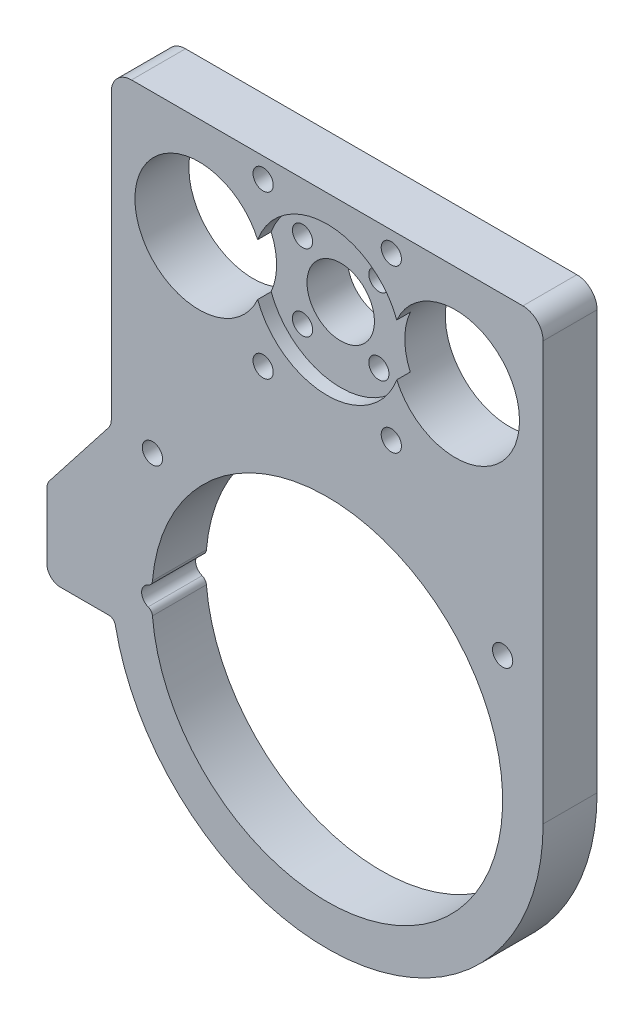
ISO-10303-21;
HEADER;
FILE_DESCRIPTION(('STEP AP214'),'2;1');
FILE_NAME('part.step','',(''),(''),'','','');
FILE_SCHEMA(('AUTOMOTIVE_DESIGN { 1 0 10303 214 1 1 1 1 }'));
ENDSEC;
DATA;
#1=APPLICATION_CONTEXT('core data for automotive mechanical design processes');
#2=APPLICATION_PROTOCOL_DEFINITION('international standard','automotive_design',2000,#1);
#3=PRODUCT_CONTEXT('',#1,'mechanical');
#4=PRODUCT('Part','Part','',(#3));
#5=PRODUCT_RELATED_PRODUCT_CATEGORY('part','',(#4));
#6=PRODUCT_DEFINITION_FORMATION('','',#4);
#7=PRODUCT_DEFINITION_CONTEXT('part definition',#1,'design');
#8=PRODUCT_DEFINITION('design','',#6,#7);
#9=PRODUCT_DEFINITION_SHAPE('','',#8);
#10=(LENGTH_UNIT() NAMED_UNIT(*) SI_UNIT(.MILLI.,.METRE.));
#11=(NAMED_UNIT(*) PLANE_ANGLE_UNIT() SI_UNIT($,.RADIAN.));
#12=(NAMED_UNIT(*) SI_UNIT($,.STERADIAN.) SOLID_ANGLE_UNIT());
#13=UNCERTAINTY_MEASURE_WITH_UNIT(LENGTH_MEASURE(1.E-05),#10,'distance_accuracy_value','');
#14=(GEOMETRIC_REPRESENTATION_CONTEXT(3) GLOBAL_UNCERTAINTY_ASSIGNED_CONTEXT((#13)) GLOBAL_UNIT_ASSIGNED_CONTEXT((#10,
#11,#12)) REPRESENTATION_CONTEXT('',''));
#15=CARTESIAN_POINT('',(0.,0.,0.));
#16=DIRECTION('',(0.,0.,1.));
#17=DIRECTION('',(1.,0.,0.));
#18=AXIS2_PLACEMENT_3D('',#15,#16,#17);
#19=CARTESIAN_POINT('',(0.,0.,8.));
#20=DIRECTION('',(0.,0.,-1.));
#21=DIRECTION('',(-1.,0.,0.));
#22=AXIS2_PLACEMENT_3D('',#19,#20,#21);
#23=CYLINDRICAL_SURFACE('',#22,5.);
#24=CARTESIAN_POINT('',(0.,0.,0.));
#25=DIRECTION('',(0.,0.,1.));
#26=DIRECTION('',(1.,0.,0.));
#27=AXIS2_PLACEMENT_3D('',#24,#25,#26);
#28=CIRCLE('',#27,5.);
#29=CARTESIAN_POINT('',(5.,0.,0.));
#30=VERTEX_POINT('',#29);
#31=EDGE_CURVE('E209',#30,#30,#28,.T.);
#32=ORIENTED_EDGE('',*,*,#31,.F.);
#33=EDGE_LOOP('',(#32));
#34=FACE_BOUND('',#33,.T.);
#35=CARTESIAN_POINT('',(0.,0.,6.));
#36=DIRECTION('',(0.,0.,1.));
#37=DIRECTION('',(1.,0.,0.));
#38=AXIS2_PLACEMENT_3D('',#35,#36,#37);
#39=CIRCLE('',#38,5.);
#40=CARTESIAN_POINT('',(5.,0.,6.));
#41=VERTEX_POINT('',#40);
#42=EDGE_CURVE('E319',#41,#41,#39,.T.);
#43=ORIENTED_EDGE('',*,*,#42,.T.);
#44=EDGE_LOOP('',(#43));
#45=FACE_BOUND('',#44,.T.);
#46=ADVANCED_FACE('F33',(#34,#45),#23,.F.);
#47=CARTESIAN_POINT('',(-5.65685424949239,5.65685424949237,8.));
#48=DIRECTION('',(0.,0.,-1.));
#49=DIRECTION('',(-1.,0.,0.));
#50=AXIS2_PLACEMENT_3D('',#47,#48,#49);
#51=CYLINDRICAL_SURFACE('',#50,1.5);
#52=CARTESIAN_POINT('',(-5.65685424949239,5.65685424949237,0.));
#53=DIRECTION('',(0.,0.,1.));
#54=DIRECTION('',(1.,0.,0.));
#55=AXIS2_PLACEMENT_3D('',#52,#53,#54);
#56=CIRCLE('',#55,1.5);
#57=CARTESIAN_POINT('',(-4.15685424949239,5.65685424949237,0.));
#58=VERTEX_POINT('',#57);
#59=EDGE_CURVE('E377',#58,#58,#56,.T.);
#60=ORIENTED_EDGE('',*,*,#59,.F.);
#61=EDGE_LOOP('',(#60));
#62=FACE_BOUND('',#61,.T.);
#63=CARTESIAN_POINT('',(-5.65685424949239,5.65685424949237,6.));
#64=DIRECTION('',(0.,0.,1.));
#65=DIRECTION('',(1.,0.,0.));
#66=AXIS2_PLACEMENT_3D('',#63,#64,#65);
#67=CIRCLE('',#66,1.5);
#68=CARTESIAN_POINT('',(-4.15685424949239,5.65685424949237,6.));
#69=VERTEX_POINT('',#68);
#70=EDGE_CURVE('E316',#69,#69,#67,.T.);
#71=ORIENTED_EDGE('',*,*,#70,.T.);
#72=EDGE_LOOP('',(#71));
#73=FACE_BOUND('',#72,.T.);
#74=ADVANCED_FACE('F435',(#62,#73),#51,.F.);
#75=CARTESIAN_POINT('',(5.65685424949239,5.65685424949237,8.));
#76=DIRECTION('',(0.,0.,-1.));
#77=DIRECTION('',(-1.,0.,0.));
#78=AXIS2_PLACEMENT_3D('',#75,#76,#77);
#79=CYLINDRICAL_SURFACE('',#78,1.5);
#80=CARTESIAN_POINT('',(5.65685424949239,5.65685424949237,0.));
#81=DIRECTION('',(0.,0.,1.));
#82=DIRECTION('',(1.,0.,0.));
#83=AXIS2_PLACEMENT_3D('',#80,#81,#82);
#84=CIRCLE('',#83,1.5);
#85=CARTESIAN_POINT('',(7.15685424949239,5.65685424949237,0.));
#86=VERTEX_POINT('',#85);
#87=EDGE_CURVE('E374',#86,#86,#84,.T.);
#88=ORIENTED_EDGE('',*,*,#87,.F.);
#89=EDGE_LOOP('',(#88));
#90=FACE_BOUND('',#89,.T.);
#91=CARTESIAN_POINT('',(5.65685424949239,5.65685424949237,6.));
#92=DIRECTION('',(0.,0.,1.));
#93=DIRECTION('',(1.,0.,0.));
#94=AXIS2_PLACEMENT_3D('',#91,#92,#93);
#95=CIRCLE('',#94,1.5);
#96=CARTESIAN_POINT('',(7.15685424949239,5.65685424949237,6.));
#97=VERTEX_POINT('',#96);
#98=EDGE_CURVE('E322',#97,#97,#95,.T.);
#99=ORIENTED_EDGE('',*,*,#98,.T.);
#100=EDGE_LOOP('',(#99));
#101=FACE_BOUND('',#100,.T.);
#102=ADVANCED_FACE('F441',(#90,#101),#79,.F.);
#103=CARTESIAN_POINT('',(5.65685424949235,-5.65685424949241,8.));
#104=DIRECTION('',(0.,0.,-1.));
#105=DIRECTION('',(-1.,0.,0.));
#106=AXIS2_PLACEMENT_3D('',#103,#104,#105);
#107=CYLINDRICAL_SURFACE('',#106,1.5);
#108=CARTESIAN_POINT('',(5.65685424949235,-5.65685424949241,0.));
#109=DIRECTION('',(0.,0.,1.));
#110=DIRECTION('',(1.,0.,0.));
#111=AXIS2_PLACEMENT_3D('',#108,#109,#110);
#112=CIRCLE('',#111,1.5);
#113=CARTESIAN_POINT('',(7.15685424949235,-5.65685424949241,0.));
#114=VERTEX_POINT('',#113);
#115=EDGE_CURVE('E371',#114,#114,#112,.T.);
#116=ORIENTED_EDGE('',*,*,#115,.F.);
#117=EDGE_LOOP('',(#116));
#118=FACE_BOUND('',#117,.T.);
#119=CARTESIAN_POINT('',(5.65685424949235,-5.65685424949241,6.));
#120=DIRECTION('',(0.,0.,1.));
#121=DIRECTION('',(1.,0.,0.));
#122=AXIS2_PLACEMENT_3D('',#119,#120,#121);
#123=CIRCLE('',#122,1.5);
#124=CARTESIAN_POINT('',(7.15685424949235,-5.65685424949241,6.));
#125=VERTEX_POINT('',#124);
#126=EDGE_CURVE('E310',#125,#125,#123,.T.);
#127=ORIENTED_EDGE('',*,*,#126,.T.);
#128=EDGE_LOOP('',(#127));
#129=FACE_BOUND('',#128,.T.);
#130=ADVANCED_FACE('F574',(#118,#129),#107,.F.);
#131=CARTESIAN_POINT('',(-5.65685424949243,-5.65685424949233,8.));
#132=DIRECTION('',(0.,0.,-1.));
#133=DIRECTION('',(-1.,0.,0.));
#134=AXIS2_PLACEMENT_3D('',#131,#132,#133);
#135=CYLINDRICAL_SURFACE('',#134,1.5);
#136=CARTESIAN_POINT('',(-5.65685424949243,-5.65685424949233,0.));
#137=DIRECTION('',(0.,0.,1.));
#138=DIRECTION('',(1.,0.,0.));
#139=AXIS2_PLACEMENT_3D('',#136,#137,#138);
#140=CIRCLE('',#139,1.5);
#141=CARTESIAN_POINT('',(-4.15685424949243,-5.65685424949233,0.));
#142=VERTEX_POINT('',#141);
#143=EDGE_CURVE('E366',#142,#142,#140,.T.);
#144=ORIENTED_EDGE('',*,*,#143,.F.);
#145=EDGE_LOOP('',(#144));
#146=FACE_BOUND('',#145,.T.);
#147=CARTESIAN_POINT('',(-5.65685424949243,-5.65685424949233,6.));
#148=DIRECTION('',(0.,0.,1.));
#149=DIRECTION('',(1.,0.,0.));
#150=AXIS2_PLACEMENT_3D('',#147,#148,#149);
#151=CIRCLE('',#150,1.5);
#152=CARTESIAN_POINT('',(-4.15685424949243,-5.65685424949233,6.));
#153=VERTEX_POINT('',#152);
#154=EDGE_CURVE('E308',#153,#153,#151,.T.);
#155=ORIENTED_EDGE('',*,*,#154,.T.);
#156=EDGE_LOOP('',(#155));
#157=FACE_BOUND('',#156,.T.);
#158=ADVANCED_FACE('F452',(#146,#157),#135,.F.);
#159=CARTESIAN_POINT('',(-39.543986336221,-43.7154165076583,8.));
#160=DIRECTION('',(0.,0.,-1.));
#161=DIRECTION('',(-1.,0.,0.));
#162=AXIS2_PLACEMENT_3D('',#159,#160,#161);
#163=PLANE('',#162);
#164=CARTESIAN_POINT('',(-19.,0.,8.));
#165=DIRECTION('',(0.,0.,1.));
#166=DIRECTION('',(1.,0.,0.));
#167=AXIS2_PLACEMENT_3D('',#164,#165,#166);
#168=CIRCLE('',#167,9.5);
#169=CARTESIAN_POINT('',(-10.3092105263158,3.83668845804552,8.));
#170=VERTEX_POINT('',#169);
#171=CARTESIAN_POINT('',(-10.3092105263158,-3.83668845804552,8.));
#172=VERTEX_POINT('',#171);
#173=EDGE_CURVE('E192',#170,#172,#168,.T.);
#174=ORIENTED_EDGE('',*,*,#173,.F.);
#175=CARTESIAN_POINT('',(0.,0.,8.));
#176=DIRECTION('',(0.,0.,1.));
#177=DIRECTION('',(1.,0.,0.));
#178=AXIS2_PLACEMENT_3D('',#175,#176,#177);
#179=CIRCLE('',#178,11.);
#180=CARTESIAN_POINT('',(10.3092105263158,3.83668845804552,8.));
#181=VERTEX_POINT('',#180);
#182=EDGE_CURVE('E177',#181,#170,#179,.T.);
#183=ORIENTED_EDGE('',*,*,#182,.F.);
#184=CARTESIAN_POINT('',(19.,0.,8.));
#185=DIRECTION('',(0.,0.,1.));
#186=DIRECTION('',(1.,0.,0.));
#187=AXIS2_PLACEMENT_3D('',#184,#185,#186);
#188=CIRCLE('',#187,9.5);
#189=CARTESIAN_POINT('',(10.3092105263158,-3.83668845804552,8.));
#190=VERTEX_POINT('',#189);
#191=EDGE_CURVE('E190',#190,#181,#188,.T.);
#192=ORIENTED_EDGE('',*,*,#191,.F.);
#193=EDGE_CURVE('E193',#172,#190,#179,.T.);
#194=ORIENTED_EDGE('',*,*,#193,.F.);
#195=EDGE_LOOP('',(#174,#183,#192,#194));
#196=FACE_BOUND('',#195,.T.);
#197=CARTESIAN_POINT('',(-39.543986336221,-43.7154165076583,8.));
#198=DIRECTION('',(0.,0.,1.));
#199=DIRECTION('',(-1.,0.,0.));
#200=AXIS2_PLACEMENT_3D('',#197,#198,#199);
#201=CIRCLE('',#200,2.);
#202=CARTESIAN_POINT('',(-41.1197426131827,-42.4837541531082,8.));
#203=VERTEX_POINT('',#202);
#204=CARTESIAN_POINT('',(-41.543986336221,-43.7154165076583,8.));
#205=VERTEX_POINT('',#204);
#206=EDGE_CURVE('E214',#203,#205,#201,.T.);
#207=ORIENTED_EDGE('',*,*,#206,.T.);
#208=DIRECTION('',(0.,-1.,0.));
#209=VECTOR('',#208,1.);
#210=CARTESIAN_POINT('',(-41.543986336221,-52.6838036105186,8.));
#211=LINE('',#210,#209);
#212=CARTESIAN_POINT('',(-41.543986336221,-53.3830220155881,8.));
#213=VERTEX_POINT('',#212);
#214=EDGE_CURVE('E217',#205,#213,#211,.T.);
#215=ORIENTED_EDGE('',*,*,#214,.T.);
#216=CARTESIAN_POINT('',(-39.543986336221,-53.3830220155881,8.));
#217=DIRECTION('',(0.,0.,1.));
#218=DIRECTION('',(1.,0.,0.));
#219=AXIS2_PLACEMENT_3D('',#216,#217,#218);
#220=CIRCLE('',#219,2.00000000000001);
#221=CARTESIAN_POINT('',(-39.543986336221,-55.3830220155881,8.));
#222=VERTEX_POINT('',#221);
#223=EDGE_CURVE('E220',#213,#222,#220,.T.);
#224=ORIENTED_EDGE('',*,*,#223,.T.);
#225=DIRECTION('',(1.,0.,0.));
#226=VECTOR('',#225,1.);
#227=CARTESIAN_POINT('',(-39.543986336221,-55.3830220155881,8.));
#228=LINE('',#227,#226);
#229=CARTESIAN_POINT('',(-32.3767977099113,-55.3830220155881,8.));
#230=VERTEX_POINT('',#229);
#231=EDGE_CURVE('E222',#222,#230,#228,.T.);
#232=ORIENTED_EDGE('',*,*,#231,.T.);
#233=CARTESIAN_POINT('',(-32.3767977099113,-56.3830220155881,8.));
#234=DIRECTION('',(0.,0.,-1.));
#235=DIRECTION('',(-1.,0.,0.));
#236=AXIS2_PLACEMENT_3D('',#233,#234,#235);
#237=CIRCLE('',#236,0.999999999999994);
#238=CARTESIAN_POINT('',(-31.3956826277928,-56.1895971060248,8.));
#239=VERTEX_POINT('',#238);
#240=EDGE_CURVE('E224',#230,#239,#237,.T.);
#241=ORIENTED_EDGE('',*,*,#240,.T.);
#242=CARTESIAN_POINT('',(0.,-50.,8.));
#243=DIRECTION('',(0.,0.,1.));
#244=DIRECTION('',(1.,0.,0.));
#245=AXIS2_PLACEMENT_3D('',#242,#243,#244);
#246=CIRCLE('',#245,32.);
#247=CARTESIAN_POINT('',(32.,-50.,8.));
#248=VERTEX_POINT('',#247);
#249=EDGE_CURVE('E226',#239,#248,#246,.T.);
#250=ORIENTED_EDGE('',*,*,#249,.T.);
#251=DIRECTION('',(0.,1.,0.));
#252=VECTOR('',#251,1.);
#253=CARTESIAN_POINT('',(32.,-50.,8.));
#254=LINE('',#253,#252);
#255=CARTESIAN_POINT('',(32.,12.,8.));
#256=VERTEX_POINT('',#255);
#257=EDGE_CURVE('E228',#248,#256,#254,.T.);
#258=ORIENTED_EDGE('',*,*,#257,.T.);
#259=CARTESIAN_POINT('',(29.,12.,8.));
#260=DIRECTION('',(0.,0.,1.));
#261=DIRECTION('',(-1.,0.,0.));
#262=AXIS2_PLACEMENT_3D('',#259,#260,#261);
#263=CIRCLE('',#262,3.);
#264=CARTESIAN_POINT('',(29.,15.,8.));
#265=VERTEX_POINT('',#264);
#266=EDGE_CURVE('E230',#256,#265,#263,.T.);
#267=ORIENTED_EDGE('',*,*,#266,.T.);
#268=DIRECTION('',(-1.,0.,0.));
#269=VECTOR('',#268,1.);
#270=CARTESIAN_POINT('',(-29.,15.,8.));
#271=LINE('',#270,#269);
#272=CARTESIAN_POINT('',(-29.,15.,8.));
#273=VERTEX_POINT('',#272);
#274=EDGE_CURVE('E232',#265,#273,#271,.T.);
#275=ORIENTED_EDGE('',*,*,#274,.T.);
#276=CARTESIAN_POINT('',(-29.,12.,8.));
#277=DIRECTION('',(0.,0.,1.));
#278=DIRECTION('',(-1.,0.,0.));
#279=AXIS2_PLACEMENT_3D('',#276,#277,#278);
#280=CIRCLE('',#279,3.);
#281=CARTESIAN_POINT('',(-32.,12.,8.));
#282=VERTEX_POINT('',#281);
#283=EDGE_CURVE('E234',#273,#282,#280,.T.);
#284=ORIENTED_EDGE('',*,*,#283,.T.);
#285=DIRECTION('',(0.,-1.,0.));
#286=VECTOR('',#285,1.);
#287=CARTESIAN_POINT('',(-32.,-17.,8.));
#288=LINE('',#287,#286);
#289=CARTESIAN_POINT('',(-32.,-30.1273002460359,8.));
#290=VERTEX_POINT('',#289);
#291=EDGE_CURVE('E236',#282,#290,#288,.T.);
#292=ORIENTED_EDGE('',*,*,#291,.T.);
#293=CARTESIAN_POINT('',(-34.,-30.1273002460359,8.));
#294=DIRECTION('',(0.,0.,-1.));
#295=DIRECTION('',(-1.,0.,0.));
#296=AXIS2_PLACEMENT_3D('',#293,#294,#295);
#297=CIRCLE('',#296,2.00000000000001);
#298=CARTESIAN_POINT('',(-32.4242437230383,-31.358962600586,8.));
#299=VERTEX_POINT('',#298);
#300=EDGE_CURVE('E238',#290,#299,#297,.T.);
#301=ORIENTED_EDGE('',*,*,#300,.T.);
#302=DIRECTION('',(-0.615831177275038,-0.787878138480844,0.));
#303=VECTOR('',#302,1.);
#304=CARTESIAN_POINT('',(-41.1197426131827,-42.4837541531082,8.));
#305=LINE('',#304,#303);
#306=EDGE_CURVE('E240',#299,#203,#305,.T.);
#307=ORIENTED_EDGE('',*,*,#306,.T.);
#308=EDGE_LOOP('',(#207,#215,#224,#232,#241,#250,#258,#267,#275,#284,#292,#301,#307));
#309=FACE_BOUND('',#308,.T.);
#310=CARTESIAN_POINT('',(-26.8990384615385,-52.3327515608557,8.));
#311=DIRECTION('',(0.,0.,-1.));
#312=DIRECTION('',(-1.,0.,0.));
#313=AXIS2_PLACEMENT_3D('',#310,#311,#312);
#314=CIRCLE('',#313,1.);
#315=CARTESIAN_POINT('',(-26.5394230769231,-51.3996509365134,8.));
#316=VERTEX_POINT('',#315);
#317=CARTESIAN_POINT('',(-25.9027777777778,-52.2463533548981,8.));
#318=VERTEX_POINT('',#317);
#319=EDGE_CURVE('E381',#316,#318,#314,.T.);
#320=ORIENTED_EDGE('',*,*,#319,.F.);
#321=CARTESIAN_POINT('',(-26.,-50.,8.));
#322=DIRECTION('',(0.,0.,1.));
#323=DIRECTION('',(1.,0.,0.));
#324=AXIS2_PLACEMENT_3D('',#321,#322,#323);
#325=CIRCLE('',#324,1.50000000000003);
#326=CARTESIAN_POINT('',(-26.5394230769231,-48.6003490634866,8.));
#327=VERTEX_POINT('',#326);
#328=EDGE_CURVE('E388',#327,#316,#325,.T.);
#329=ORIENTED_EDGE('',*,*,#328,.F.);
#330=CARTESIAN_POINT('',(-26.8990384615385,-47.6672484391443,8.));
#331=DIRECTION('',(0.,0.,-1.));
#332=DIRECTION('',(1.,0.,0.));
#333=AXIS2_PLACEMENT_3D('',#330,#331,#332);
#334=CIRCLE('',#333,1.);
#335=CARTESIAN_POINT('',(-25.9027777777778,-47.7536466451019,8.));
#336=VERTEX_POINT('',#335);
#337=EDGE_CURVE('E386',#336,#327,#334,.T.);
#338=ORIENTED_EDGE('',*,*,#337,.F.);
#339=CARTESIAN_POINT('',(0.,-50.,8.));
#340=DIRECTION('',(0.,0.,1.));
#341=DIRECTION('',(1.,0.,0.));
#342=AXIS2_PLACEMENT_3D('',#339,#340,#341);
#343=CIRCLE('',#342,26.);
#344=EDGE_CURVE('E383',#318,#336,#343,.T.);
#345=ORIENTED_EDGE('',*,*,#344,.F.);
#346=EDGE_LOOP('',(#320,#329,#338,#345));
#347=FACE_BOUND('',#346,.T.);
#348=CARTESIAN_POINT('',(-9.5,12.,8.));
#349=DIRECTION('',(0.,0.,1.));
#350=DIRECTION('',(1.,0.,0.));
#351=AXIS2_PLACEMENT_3D('',#348,#349,#350);
#352=CIRCLE('',#351,1.5);
#353=CARTESIAN_POINT('',(-8.,12.,8.));
#354=VERTEX_POINT('',#353);
#355=EDGE_CURVE('E363',#354,#354,#352,.T.);
#356=ORIENTED_EDGE('',*,*,#355,.F.);
#357=EDGE_LOOP('',(#356));
#358=FACE_BOUND('',#357,.T.);
#359=CARTESIAN_POINT('',(9.5,12.,8.));
#360=DIRECTION('',(0.,0.,1.));
#361=DIRECTION('',(1.,0.,0.));
#362=AXIS2_PLACEMENT_3D('',#359,#360,#361);
#363=CIRCLE('',#362,1.5);
#364=CARTESIAN_POINT('',(11.,12.,8.));
#365=VERTEX_POINT('',#364);
#366=EDGE_CURVE('E357',#365,#365,#363,.T.);
#367=ORIENTED_EDGE('',*,*,#366,.F.);
#368=EDGE_LOOP('',(#367));
#369=FACE_BOUND('',#368,.T.);
#370=CARTESIAN_POINT('',(9.5,-12.,8.));
#371=DIRECTION('',(0.,0.,1.));
#372=DIRECTION('',(1.,0.,0.));
#373=AXIS2_PLACEMENT_3D('',#370,#371,#372);
#374=CIRCLE('',#373,1.5);
#375=CARTESIAN_POINT('',(11.,-12.,8.));
#376=VERTEX_POINT('',#375);
#377=EDGE_CURVE('E351',#376,#376,#374,.T.);
#378=ORIENTED_EDGE('',*,*,#377,.F.);
#379=EDGE_LOOP('',(#378));
#380=FACE_BOUND('',#379,.T.);
#381=CARTESIAN_POINT('',(-9.5,-12.,8.));
#382=DIRECTION('',(0.,0.,1.));
#383=DIRECTION('',(1.,0.,0.));
#384=AXIS2_PLACEMENT_3D('',#381,#382,#383);
#385=CIRCLE('',#384,1.5);
#386=CARTESIAN_POINT('',(-8.,-12.,8.));
#387=VERTEX_POINT('',#386);
#388=EDGE_CURVE('E345',#387,#387,#385,.T.);
#389=ORIENTED_EDGE('',*,*,#388,.F.);
#390=EDGE_LOOP('',(#389));
#391=FACE_BOUND('',#390,.T.);
#392=CARTESIAN_POINT('',(-25.9027777777778,-31.358962600586,8.));
#393=DIRECTION('',(0.,0.,1.));
#394=DIRECTION('',(1.,0.,0.));
#395=AXIS2_PLACEMENT_3D('',#392,#393,#394);
#396=CIRCLE('',#395,1.5);
#397=CARTESIAN_POINT('',(-24.4027777777778,-31.358962600586,8.));
#398=VERTEX_POINT('',#397);
#399=EDGE_CURVE('E339',#398,#398,#396,.T.);
#400=ORIENTED_EDGE('',*,*,#399,.F.);
#401=EDGE_LOOP('',(#400));
#402=FACE_BOUND('',#401,.T.);
#403=CARTESIAN_POINT('',(26.,-31.358962600586,8.));
#404=DIRECTION('',(0.,0.,1.));
#405=DIRECTION('',(1.,0.,0.));
#406=AXIS2_PLACEMENT_3D('',#403,#404,#405);
#407=CIRCLE('',#406,1.5);
#408=CARTESIAN_POINT('',(27.5,-31.358962600586,8.));
#409=VERTEX_POINT('',#408);
#410=EDGE_CURVE('E333',#409,#409,#407,.T.);
#411=ORIENTED_EDGE('',*,*,#410,.F.);
#412=EDGE_LOOP('',(#411));
#413=FACE_BOUND('',#412,.T.);
#414=ADVANCED_FACE('F187',(#196,#309,#347,#358,#369,#380,#391,#402,#413),#163,.F.);
#415=CARTESIAN_POINT('',(-39.543986336221,-43.7154165076583,0.));
#416=DIRECTION('',(0.,0.,-1.));
#417=DIRECTION('',(-1.,0.,0.));
#418=AXIS2_PLACEMENT_3D('',#415,#416,#417);
#419=PLANE('',#418);
#420=CARTESIAN_POINT('',(-25.9027777777778,-31.358962600586,0.));
#421=DIRECTION('',(0.,0.,1.));
#422=DIRECTION('',(1.,0.,0.));
#423=AXIS2_PLACEMENT_3D('',#420,#421,#422);
#424=CIRCLE('',#423,1.5);
#425=CARTESIAN_POINT('',(-24.4027777777778,-31.358962600586,0.));
#426=VERTEX_POINT('',#425);
#427=EDGE_CURVE('E336',#426,#426,#424,.T.);
#428=ORIENTED_EDGE('',*,*,#427,.T.);
#429=EDGE_LOOP('',(#428));
#430=FACE_BOUND('',#429,.T.);
#431=CARTESIAN_POINT('',(9.5,-12.,0.));
#432=DIRECTION('',(0.,0.,1.));
#433=DIRECTION('',(1.,0.,0.));
#434=AXIS2_PLACEMENT_3D('',#431,#432,#433);
#435=CIRCLE('',#434,1.5);
#436=CARTESIAN_POINT('',(11.,-12.,0.));
#437=VERTEX_POINT('',#436);
#438=EDGE_CURVE('E348',#437,#437,#435,.T.);
#439=ORIENTED_EDGE('',*,*,#438,.T.);
#440=EDGE_LOOP('',(#439));
#441=FACE_BOUND('',#440,.T.);
#442=CARTESIAN_POINT('',(-9.5,12.,0.));
#443=DIRECTION('',(0.,0.,1.));
#444=DIRECTION('',(1.,0.,0.));
#445=AXIS2_PLACEMENT_3D('',#442,#443,#444);
#446=CIRCLE('',#445,1.5);
#447=CARTESIAN_POINT('',(-8.,12.,0.));
#448=VERTEX_POINT('',#447);
#449=EDGE_CURVE('E360',#448,#448,#446,.T.);
#450=ORIENTED_EDGE('',*,*,#449,.T.);
#451=EDGE_LOOP('',(#450));
#452=FACE_BOUND('',#451,.T.);
#453=ORIENTED_EDGE('',*,*,#115,.T.);
#454=EDGE_LOOP('',(#453));
#455=FACE_BOUND('',#454,.T.);
#456=ORIENTED_EDGE('',*,*,#59,.T.);
#457=EDGE_LOOP('',(#456));
#458=FACE_BOUND('',#457,.T.);
#459=CARTESIAN_POINT('',(-19.,0.,0.));
#460=DIRECTION('',(0.,0.,1.));
#461=DIRECTION('',(1.,0.,0.));
#462=AXIS2_PLACEMENT_3D('',#459,#460,#461);
#463=CIRCLE('',#462,9.5);
#464=CARTESIAN_POINT('',(-9.5,0.,0.));
#465=VERTEX_POINT('',#464);
#466=EDGE_CURVE('E198',#465,#465,#463,.T.);
#467=ORIENTED_EDGE('',*,*,#466,.T.);
#468=EDGE_LOOP('',(#467));
#469=FACE_BOUND('',#468,.T.);
#470=CARTESIAN_POINT('',(-39.543986336221,-43.7154165076583,0.));
#471=DIRECTION('',(0.,0.,1.));
#472=DIRECTION('',(-1.,0.,0.));
#473=AXIS2_PLACEMENT_3D('',#470,#471,#472);
#474=CIRCLE('',#473,2.);
#475=CARTESIAN_POINT('',(-41.1197426131827,-42.4837541531082,0.));
#476=VERTEX_POINT('',#475);
#477=CARTESIAN_POINT('',(-41.543986336221,-43.7154165076583,0.));
#478=VERTEX_POINT('',#477);
#479=EDGE_CURVE('E213',#476,#478,#474,.T.);
#480=ORIENTED_EDGE('',*,*,#479,.F.);
#481=DIRECTION('',(-0.615831177275038,-0.787878138480844,0.));
#482=VECTOR('',#481,1.);
#483=CARTESIAN_POINT('',(-41.1197426131827,-42.4837541531082,0.));
#484=LINE('',#483,#482);
#485=CARTESIAN_POINT('',(-32.4242437230383,-31.358962600586,0.));
#486=VERTEX_POINT('',#485);
#487=EDGE_CURVE('E218',#486,#476,#484,.T.);
#488=ORIENTED_EDGE('',*,*,#487,.F.);
#489=CARTESIAN_POINT('',(-34.,-30.1273002460359,0.));
#490=DIRECTION('',(0.,0.,-1.));
#491=DIRECTION('',(-1.,0.,0.));
#492=AXIS2_PLACEMENT_3D('',#489,#490,#491);
#493=CIRCLE('',#492,2.00000000000001);
#494=CARTESIAN_POINT('',(-32.,-30.1273002460359,0.));
#495=VERTEX_POINT('',#494);
#496=EDGE_CURVE('E267',#495,#486,#493,.T.);
#497=ORIENTED_EDGE('',*,*,#496,.F.);
#498=DIRECTION('',(0.,-1.,0.));
#499=VECTOR('',#498,1.);
#500=CARTESIAN_POINT('',(-32.,-30.1273002460359,0.));
#501=LINE('',#500,#499);
#502=CARTESIAN_POINT('',(-32.,12.,0.));
#503=VERTEX_POINT('',#502);
#504=EDGE_CURVE('E265',#503,#495,#501,.T.);
#505=ORIENTED_EDGE('',*,*,#504,.F.);
#506=CARTESIAN_POINT('',(-29.,12.,0.));
#507=DIRECTION('',(0.,0.,1.));
#508=DIRECTION('',(-1.,0.,0.));
#509=AXIS2_PLACEMENT_3D('',#506,#507,#508);
#510=CIRCLE('',#509,3.);
#511=CARTESIAN_POINT('',(-29.,15.,0.));
#512=VERTEX_POINT('',#511);
#513=EDGE_CURVE('E262',#512,#503,#510,.T.);
#514=ORIENTED_EDGE('',*,*,#513,.F.);
#515=DIRECTION('',(-1.,0.,0.));
#516=VECTOR('',#515,1.);
#517=CARTESIAN_POINT('',(-29.,15.,0.));
#518=LINE('',#517,#516);
#519=CARTESIAN_POINT('',(29.,15.,0.));
#520=VERTEX_POINT('',#519);
#521=EDGE_CURVE('E260',#520,#512,#518,.T.);
#522=ORIENTED_EDGE('',*,*,#521,.F.);
#523=CARTESIAN_POINT('',(29.,12.,0.));
#524=DIRECTION('',(0.,0.,1.));
#525=DIRECTION('',(-1.,0.,0.));
#526=AXIS2_PLACEMENT_3D('',#523,#524,#525);
#527=CIRCLE('',#526,3.);
#528=CARTESIAN_POINT('',(32.,12.,0.));
#529=VERTEX_POINT('',#528);
#530=EDGE_CURVE('E258',#529,#520,#527,.T.);
#531=ORIENTED_EDGE('',*,*,#530,.F.);
#532=DIRECTION('',(0.,1.,0.));
#533=VECTOR('',#532,1.);
#534=CARTESIAN_POINT('',(32.,-17.,0.));
#535=LINE('',#534,#533);
#536=CARTESIAN_POINT('',(32.,-50.,0.));
#537=VERTEX_POINT('',#536);
#538=EDGE_CURVE('E256',#537,#529,#535,.T.);
#539=ORIENTED_EDGE('',*,*,#538,.F.);
#540=CARTESIAN_POINT('',(0.,-50.,0.));
#541=DIRECTION('',(0.,0.,1.));
#542=DIRECTION('',(1.,0.,0.));
#543=AXIS2_PLACEMENT_3D('',#540,#541,#542);
#544=CIRCLE('',#543,32.);
#545=CARTESIAN_POINT('',(-31.3956826277928,-56.1895971060248,0.));
#546=VERTEX_POINT('',#545);
#547=EDGE_CURVE('E253',#546,#537,#544,.T.);
#548=ORIENTED_EDGE('',*,*,#547,.F.);
#549=CARTESIAN_POINT('',(-32.3767977099113,-56.3830220155881,0.));
#550=DIRECTION('',(0.,0.,-1.));
#551=DIRECTION('',(-1.,0.,0.));
#552=AXIS2_PLACEMENT_3D('',#549,#550,#551);
#553=CIRCLE('',#552,0.999999999999994);
#554=CARTESIAN_POINT('',(-32.3767977099113,-55.3830220155881,0.));
#555=VERTEX_POINT('',#554);
#556=EDGE_CURVE('E251',#555,#546,#553,.T.);
#557=ORIENTED_EDGE('',*,*,#556,.F.);
#558=DIRECTION('',(1.,0.,0.));
#559=VECTOR('',#558,1.);
#560=CARTESIAN_POINT('',(-39.543986336221,-55.3830220155881,0.));
#561=LINE('',#560,#559);
#562=CARTESIAN_POINT('',(-39.543986336221,-55.3830220155881,0.));
#563=VERTEX_POINT('',#562);
#564=EDGE_CURVE('E249',#563,#555,#561,.T.);
#565=ORIENTED_EDGE('',*,*,#564,.F.);
#566=CARTESIAN_POINT('',(-39.543986336221,-53.3830220155881,0.));
#567=DIRECTION('',(0.,0.,1.));
#568=DIRECTION('',(1.,0.,0.));
#569=AXIS2_PLACEMENT_3D('',#566,#567,#568);
#570=CIRCLE('',#569,2.00000000000001);
#571=CARTESIAN_POINT('',(-41.543986336221,-53.3830220155881,0.));
#572=VERTEX_POINT('',#571);
#573=EDGE_CURVE('E247',#572,#563,#570,.T.);
#574=ORIENTED_EDGE('',*,*,#573,.F.);
#575=DIRECTION('',(0.,-1.,0.));
#576=VECTOR('',#575,1.);
#577=CARTESIAN_POINT('',(-41.543986336221,-52.6838036105186,0.));
#578=LINE('',#577,#576);
#579=EDGE_CURVE('E245',#478,#572,#578,.T.);
#580=ORIENTED_EDGE('',*,*,#579,.F.);
#581=EDGE_LOOP('',(#480,#488,#497,#505,#514,#522,#531,#539,#548,#557,#565,#574,#580));
#582=FACE_BOUND('',#581,.T.);
#583=ORIENTED_EDGE('',*,*,#31,.T.);
#584=EDGE_LOOP('',(#583));
#585=FACE_BOUND('',#584,.T.);
#586=CARTESIAN_POINT('',(19.,0.,0.));
#587=DIRECTION('',(0.,0.,1.));
#588=DIRECTION('',(1.,0.,0.));
#589=AXIS2_PLACEMENT_3D('',#586,#587,#588);
#590=CIRCLE('',#589,9.5);
#591=CARTESIAN_POINT('',(28.5,0.,0.));
#592=VERTEX_POINT('',#591);
#593=EDGE_CURVE('E199',#592,#592,#590,.T.);
#594=ORIENTED_EDGE('',*,*,#593,.T.);
#595=EDGE_LOOP('',(#594));
#596=FACE_BOUND('',#595,.T.);
#597=CARTESIAN_POINT('',(-26.,-50.,0.));
#598=DIRECTION('',(0.,0.,1.));
#599=DIRECTION('',(1.,0.,0.));
#600=AXIS2_PLACEMENT_3D('',#597,#598,#599);
#601=CIRCLE('',#600,1.50000000000003);
#602=CARTESIAN_POINT('',(-26.5394230769231,-48.6003490634866,0.));
#603=VERTEX_POINT('',#602);
#604=CARTESIAN_POINT('',(-26.5394230769231,-51.3996509365134,0.));
#605=VERTEX_POINT('',#604);
#606=EDGE_CURVE('E384',#603,#605,#601,.T.);
#607=ORIENTED_EDGE('',*,*,#606,.T.);
#608=CARTESIAN_POINT('',(-26.8990384615385,-52.3327515608557,0.));
#609=DIRECTION('',(0.,0.,-1.));
#610=DIRECTION('',(-1.,0.,0.));
#611=AXIS2_PLACEMENT_3D('',#608,#609,#610);
#612=CIRCLE('',#611,1.);
#613=CARTESIAN_POINT('',(-25.9027777777778,-52.2463533548981,0.));
#614=VERTEX_POINT('',#613);
#615=EDGE_CURVE('E380',#605,#614,#612,.T.);
#616=ORIENTED_EDGE('',*,*,#615,.T.);
#617=CARTESIAN_POINT('',(0.,-50.,0.));
#618=DIRECTION('',(0.,0.,1.));
#619=DIRECTION('',(1.,0.,0.));
#620=AXIS2_PLACEMENT_3D('',#617,#618,#619);
#621=CIRCLE('',#620,26.);
#622=CARTESIAN_POINT('',(-25.9027777777778,-47.7536466451019,0.));
#623=VERTEX_POINT('',#622);
#624=EDGE_CURVE('E393',#614,#623,#621,.T.);
#625=ORIENTED_EDGE('',*,*,#624,.T.);
#626=CARTESIAN_POINT('',(-26.8990384615385,-47.6672484391443,0.));
#627=DIRECTION('',(0.,0.,-1.));
#628=DIRECTION('',(1.,0.,0.));
#629=AXIS2_PLACEMENT_3D('',#626,#627,#628);
#630=CIRCLE('',#629,1.);
#631=EDGE_CURVE('E396',#623,#603,#630,.T.);
#632=ORIENTED_EDGE('',*,*,#631,.T.);
#633=EDGE_LOOP('',(#607,#616,#625,#632));
#634=FACE_BOUND('',#633,.T.);
#635=ORIENTED_EDGE('',*,*,#87,.T.);
#636=EDGE_LOOP('',(#635));
#637=FACE_BOUND('',#636,.T.);
#638=ORIENTED_EDGE('',*,*,#143,.T.);
#639=EDGE_LOOP('',(#638));
#640=FACE_BOUND('',#639,.T.);
#641=CARTESIAN_POINT('',(9.5,12.,0.));
#642=DIRECTION('',(0.,0.,1.));
#643=DIRECTION('',(1.,0.,0.));
#644=AXIS2_PLACEMENT_3D('',#641,#642,#643);
#645=CIRCLE('',#644,1.5);
#646=CARTESIAN_POINT('',(11.,12.,0.));
#647=VERTEX_POINT('',#646);
#648=EDGE_CURVE('E354',#647,#647,#645,.T.);
#649=ORIENTED_EDGE('',*,*,#648,.T.);
#650=EDGE_LOOP('',(#649));
#651=FACE_BOUND('',#650,.T.);
#652=CARTESIAN_POINT('',(-9.5,-12.,0.));
#653=DIRECTION('',(0.,0.,1.));
#654=DIRECTION('',(1.,0.,0.));
#655=AXIS2_PLACEMENT_3D('',#652,#653,#654);
#656=CIRCLE('',#655,1.5);
#657=CARTESIAN_POINT('',(-8.,-12.,0.));
#658=VERTEX_POINT('',#657);
#659=EDGE_CURVE('E342',#658,#658,#656,.T.);
#660=ORIENTED_EDGE('',*,*,#659,.T.);
#661=EDGE_LOOP('',(#660));
#662=FACE_BOUND('',#661,.T.);
#663=CARTESIAN_POINT('',(26.,-31.358962600586,0.));
#664=DIRECTION('',(0.,0.,1.));
#665=DIRECTION('',(1.,0.,0.));
#666=AXIS2_PLACEMENT_3D('',#663,#664,#665);
#667=CIRCLE('',#666,1.5);
#668=CARTESIAN_POINT('',(27.5,-31.358962600586,0.));
#669=VERTEX_POINT('',#668);
#670=EDGE_CURVE('E332',#669,#669,#667,.T.);
#671=ORIENTED_EDGE('',*,*,#670,.T.);
#672=EDGE_LOOP('',(#671));
#673=FACE_BOUND('',#672,.T.);
#674=ADVANCED_FACE('F415',(#430,#441,#452,#455,#458,#469,#582,#585,#596,#634,#637,#640,#651,
#662,#673),#419,.T.);
#675=CARTESIAN_POINT('',(-39.543986336221,-43.7154165076583,8.));
#676=DIRECTION('',(0.,0.,-1.));
#677=DIRECTION('',(-1.,0.,0.));
#678=AXIS2_PLACEMENT_3D('',#675,#676,#677);
#679=CYLINDRICAL_SURFACE('',#678,2.);
#680=ORIENTED_EDGE('',*,*,#479,.T.);
#681=DIRECTION('',(0.,0.,-1.));
#682=VECTOR('',#681,1.);
#683=CARTESIAN_POINT('',(-41.543986336221,-43.7154165076583,8.));
#684=LINE('',#683,#682);
#685=EDGE_CURVE('E305',#205,#478,#684,.T.);
#686=ORIENTED_EDGE('',*,*,#685,.F.);
#687=ORIENTED_EDGE('',*,*,#206,.F.);
#688=DIRECTION('',(0.,0.,-1.));
#689=VECTOR('',#688,1.);
#690=CARTESIAN_POINT('',(-41.1197426131827,-42.4837541531082,8.));
#691=LINE('',#690,#689);
#692=EDGE_CURVE('E242',#203,#476,#691,.T.);
#693=ORIENTED_EDGE('',*,*,#692,.T.);
#694=EDGE_LOOP('',(#680,#686,#687,#693));
#695=FACE_BOUND('',#694,.T.);
#696=ADVANCED_FACE('F35',(#695),#679,.T.);
#697=CARTESIAN_POINT('',(-41.543986336221,-52.6838036105186,8.));
#698=DIRECTION('',(1.,0.,0.));
#699=DIRECTION('',(0.,1.,0.));
#700=AXIS2_PLACEMENT_3D('',#697,#698,#699);
#701=PLANE('',#700);
#702=ORIENTED_EDGE('',*,*,#579,.T.);
#703=DIRECTION('',(0.,0.,-1.));
#704=VECTOR('',#703,1.);
#705=CARTESIAN_POINT('',(-41.543986336221,-53.3830220155881,8.));
#706=LINE('',#705,#704);
#707=EDGE_CURVE('E302',#213,#572,#706,.T.);
#708=ORIENTED_EDGE('',*,*,#707,.F.);
#709=ORIENTED_EDGE('',*,*,#214,.F.);
#710=ORIENTED_EDGE('',*,*,#685,.T.);
#711=EDGE_LOOP('',(#702,#708,#709,#710));
#712=FACE_BOUND('',#711,.T.);
#713=ADVANCED_FACE('F498',(#712),#701,.F.);
#714=CARTESIAN_POINT('',(-39.543986336221,-53.3830220155881,8.));
#715=DIRECTION('',(0.,0.,-1.));
#716=DIRECTION('',(-1.,0.,0.));
#717=AXIS2_PLACEMENT_3D('',#714,#715,#716);
#718=CYLINDRICAL_SURFACE('',#717,2.00000000000001);
#719=ORIENTED_EDGE('',*,*,#573,.T.);
#720=DIRECTION('',(0.,0.,-1.));
#721=VECTOR('',#720,1.);
#722=CARTESIAN_POINT('',(-39.543986336221,-55.3830220155881,8.));
#723=LINE('',#722,#721);
#724=EDGE_CURVE('E299',#222,#563,#723,.T.);
#725=ORIENTED_EDGE('',*,*,#724,.F.);
#726=ORIENTED_EDGE('',*,*,#223,.F.);
#727=ORIENTED_EDGE('',*,*,#707,.T.);
#728=EDGE_LOOP('',(#719,#725,#726,#727));
#729=FACE_BOUND('',#728,.T.);
#730=ADVANCED_FACE('F495',(#729),#718,.T.);
#731=CARTESIAN_POINT('',(-39.543986336221,-55.3830220155881,8.));
#732=DIRECTION('',(0.,1.,0.));
#733=DIRECTION('',(-1.,0.,0.));
#734=AXIS2_PLACEMENT_3D('',#731,#732,#733);
#735=PLANE('',#734);
#736=ORIENTED_EDGE('',*,*,#564,.T.);
#737=DIRECTION('',(0.,0.,-1.));
#738=VECTOR('',#737,1.);
#739=CARTESIAN_POINT('',(-32.3767977099113,-55.3830220155881,8.));
#740=LINE('',#739,#738);
#741=EDGE_CURVE('E296',#230,#555,#740,.T.);
#742=ORIENTED_EDGE('',*,*,#741,.F.);
#743=ORIENTED_EDGE('',*,*,#231,.F.);
#744=ORIENTED_EDGE('',*,*,#724,.T.);
#745=EDGE_LOOP('',(#736,#742,#743,#744));
#746=FACE_BOUND('',#745,.T.);
#747=ADVANCED_FACE('F491',(#746),#735,.F.);
#748=CARTESIAN_POINT('',(-32.3767977099113,-56.3830220155881,8.));
#749=DIRECTION('',(0.,0.,-1.));
#750=DIRECTION('',(-1.,0.,0.));
#751=AXIS2_PLACEMENT_3D('',#748,#749,#750);
#752=CYLINDRICAL_SURFACE('',#751,0.999999999999994);
#753=ORIENTED_EDGE('',*,*,#556,.T.);
#754=DIRECTION('',(0.,0.,-1.));
#755=VECTOR('',#754,1.);
#756=CARTESIAN_POINT('',(-31.3956826277928,-56.1895971060248,8.));
#757=LINE('',#756,#755);
#758=EDGE_CURVE('E293',#239,#546,#757,.T.);
#759=ORIENTED_EDGE('',*,*,#758,.F.);
#760=ORIENTED_EDGE('',*,*,#240,.F.);
#761=ORIENTED_EDGE('',*,*,#741,.T.);
#762=EDGE_LOOP('',(#753,#759,#760,#761));
#763=FACE_BOUND('',#762,.T.);
#764=ADVANCED_FACE('F487',(#763),#752,.F.);
#765=CARTESIAN_POINT('',(0.,-50.,8.));
#766=DIRECTION('',(0.,0.,-1.));
#767=DIRECTION('',(-1.,0.,0.));
#768=AXIS2_PLACEMENT_3D('',#765,#766,#767);
#769=CYLINDRICAL_SURFACE('',#768,32.);
#770=ORIENTED_EDGE('',*,*,#547,.T.);
#771=DIRECTION('',(0.,0.,-1.));
#772=VECTOR('',#771,1.);
#773=CARTESIAN_POINT('',(32.,-50.,8.));
#774=LINE('',#773,#772);
#775=EDGE_CURVE('E290',#248,#537,#774,.T.);
#776=ORIENTED_EDGE('',*,*,#775,.F.);
#777=ORIENTED_EDGE('',*,*,#249,.F.);
#778=ORIENTED_EDGE('',*,*,#758,.T.);
#779=EDGE_LOOP('',(#770,#776,#777,#778));
#780=FACE_BOUND('',#779,.T.);
#781=ADVANCED_FACE('F483',(#780),#769,.T.);
#782=CARTESIAN_POINT('',(32.,-17.,8.));
#783=DIRECTION('',(-1.,0.,0.));
#784=DIRECTION('',(0.,0.,1.));
#785=AXIS2_PLACEMENT_3D('',#782,#783,#784);
#786=PLANE('',#785);
#787=ORIENTED_EDGE('',*,*,#538,.T.);
#788=DIRECTION('',(0.,0.,-1.));
#789=VECTOR('',#788,1.);
#790=CARTESIAN_POINT('',(32.,12.,8.));
#791=LINE('',#790,#789);
#792=EDGE_CURVE('E287',#256,#529,#791,.T.);
#793=ORIENTED_EDGE('',*,*,#792,.F.);
#794=ORIENTED_EDGE('',*,*,#257,.F.);
#795=ORIENTED_EDGE('',*,*,#775,.T.);
#796=EDGE_LOOP('',(#787,#793,#794,#795));
#797=FACE_BOUND('',#796,.T.);
#798=ADVANCED_FACE('F479',(#797),#786,.F.);
#799=CARTESIAN_POINT('',(29.,12.,8.));
#800=DIRECTION('',(0.,0.,-1.));
#801=DIRECTION('',(-1.,0.,0.));
#802=AXIS2_PLACEMENT_3D('',#799,#800,#801);
#803=CYLINDRICAL_SURFACE('',#802,3.);
#804=ORIENTED_EDGE('',*,*,#530,.T.);
#805=DIRECTION('',(0.,0.,-1.));
#806=VECTOR('',#805,1.);
#807=CARTESIAN_POINT('',(29.,15.,8.));
#808=LINE('',#807,#806);
#809=EDGE_CURVE('E284',#265,#520,#808,.T.);
#810=ORIENTED_EDGE('',*,*,#809,.F.);
#811=ORIENTED_EDGE('',*,*,#266,.F.);
#812=ORIENTED_EDGE('',*,*,#792,.T.);
#813=EDGE_LOOP('',(#804,#810,#811,#812));
#814=FACE_BOUND('',#813,.T.);
#815=ADVANCED_FACE('F475',(#814),#803,.T.);
#816=CARTESIAN_POINT('',(-29.,15.,8.));
#817=DIRECTION('',(0.,-1.,0.));
#818=DIRECTION('',(0.,0.,-1.));
#819=AXIS2_PLACEMENT_3D('',#816,#817,#818);
#820=PLANE('',#819);
#821=ORIENTED_EDGE('',*,*,#521,.T.);
#822=DIRECTION('',(0.,0.,-1.));
#823=VECTOR('',#822,1.);
#824=CARTESIAN_POINT('',(-29.,15.,8.));
#825=LINE('',#824,#823);
#826=EDGE_CURVE('E281',#273,#512,#825,.T.);
#827=ORIENTED_EDGE('',*,*,#826,.F.);
#828=ORIENTED_EDGE('',*,*,#274,.F.);
#829=ORIENTED_EDGE('',*,*,#809,.T.);
#830=EDGE_LOOP('',(#821,#827,#828,#829));
#831=FACE_BOUND('',#830,.T.);
#832=ADVANCED_FACE('F471',(#831),#820,.F.);
#833=CARTESIAN_POINT('',(-29.,12.,8.));
#834=DIRECTION('',(0.,0.,-1.));
#835=DIRECTION('',(-1.,0.,0.));
#836=AXIS2_PLACEMENT_3D('',#833,#834,#835);
#837=CYLINDRICAL_SURFACE('',#836,3.);
#838=ORIENTED_EDGE('',*,*,#513,.T.);
#839=DIRECTION('',(0.,0.,-1.));
#840=VECTOR('',#839,1.);
#841=CARTESIAN_POINT('',(-32.,12.,8.));
#842=LINE('',#841,#840);
#843=EDGE_CURVE('E278',#282,#503,#842,.T.);
#844=ORIENTED_EDGE('',*,*,#843,.F.);
#845=ORIENTED_EDGE('',*,*,#283,.F.);
#846=ORIENTED_EDGE('',*,*,#826,.T.);
#847=EDGE_LOOP('',(#838,#844,#845,#846));
#848=FACE_BOUND('',#847,.T.);
#849=ADVANCED_FACE('F467',(#848),#837,.T.);
#850=CARTESIAN_POINT('',(-32.,-30.1273002460359,8.));
#851=DIRECTION('',(1.,0.,0.));
#852=DIRECTION('',(0.,1.,0.));
#853=AXIS2_PLACEMENT_3D('',#850,#851,#852);
#854=PLANE('',#853);
#855=ORIENTED_EDGE('',*,*,#504,.T.);
#856=DIRECTION('',(0.,0.,-1.));
#857=VECTOR('',#856,1.);
#858=CARTESIAN_POINT('',(-32.,-30.1273002460359,8.));
#859=LINE('',#858,#857);
#860=EDGE_CURVE('E275',#290,#495,#859,.T.);
#861=ORIENTED_EDGE('',*,*,#860,.F.);
#862=ORIENTED_EDGE('',*,*,#291,.F.);
#863=ORIENTED_EDGE('',*,*,#843,.T.);
#864=EDGE_LOOP('',(#855,#861,#862,#863));
#865=FACE_BOUND('',#864,.T.);
#866=ADVANCED_FACE('F463',(#865),#854,.F.);
#867=CARTESIAN_POINT('',(-34.,-30.1273002460359,8.));
#868=DIRECTION('',(0.,0.,-1.));
#869=DIRECTION('',(-1.,0.,0.));
#870=AXIS2_PLACEMENT_3D('',#867,#868,#869);
#871=CYLINDRICAL_SURFACE('',#870,2.00000000000001);
#872=ORIENTED_EDGE('',*,*,#496,.T.);
#873=DIRECTION('',(0.,0.,-1.));
#874=VECTOR('',#873,1.);
#875=CARTESIAN_POINT('',(-32.4242437230383,-31.358962600586,8.));
#876=LINE('',#875,#874);
#877=EDGE_CURVE('E272',#299,#486,#876,.T.);
#878=ORIENTED_EDGE('',*,*,#877,.F.);
#879=ORIENTED_EDGE('',*,*,#300,.F.);
#880=ORIENTED_EDGE('',*,*,#860,.T.);
#881=EDGE_LOOP('',(#872,#878,#879,#880));
#882=FACE_BOUND('',#881,.T.);
#883=ADVANCED_FACE('F459',(#882),#871,.F.);
#884=CARTESIAN_POINT('',(-41.1197426131827,-42.4837541531082,8.));
#885=DIRECTION('',(0.787878138480844,-0.615831177275038,0.));
#886=DIRECTION('',(0.615831177275038,0.787878138480844,0.));
#887=AXIS2_PLACEMENT_3D('',#884,#885,#886);
#888=PLANE('',#887);
#889=ORIENTED_EDGE('',*,*,#487,.T.);
#890=ORIENTED_EDGE('',*,*,#692,.F.);
#891=ORIENTED_EDGE('',*,*,#306,.F.);
#892=ORIENTED_EDGE('',*,*,#877,.T.);
#893=EDGE_LOOP('',(#889,#890,#891,#892));
#894=FACE_BOUND('',#893,.T.);
#895=ADVANCED_FACE('F456',(#894),#888,.F.);
#896=CARTESIAN_POINT('',(-19.,0.,8.));
#897=DIRECTION('',(0.,0.,-1.));
#898=DIRECTION('',(-1.,0.,0.));
#899=AXIS2_PLACEMENT_3D('',#896,#897,#898);
#900=CYLINDRICAL_SURFACE('',#899,9.5);
#901=DIRECTION('',(0.,0.,1.));
#902=VECTOR('',#901,1.);
#903=CARTESIAN_POINT('',(-10.3092105263158,-3.83668845804552,7.));
#904=LINE('',#903,#902);
#905=CARTESIAN_POINT('',(-10.3092105263158,-3.83668845804552,6.));
#906=VERTEX_POINT('',#905);
#907=EDGE_CURVE('E330',#906,#172,#904,.T.);
#908=ORIENTED_EDGE('',*,*,#907,.F.);
#909=CARTESIAN_POINT('',(-19.,0.,6.));
#910=DIRECTION('',(0.,0.,1.));
#911=DIRECTION('',(1.,0.,0.));
#912=AXIS2_PLACEMENT_3D('',#909,#910,#911);
#913=CIRCLE('',#912,9.5);
#914=CARTESIAN_POINT('',(-10.3092105263158,3.83668845804552,6.));
#915=VERTEX_POINT('',#914);
#916=EDGE_CURVE('E315',#906,#915,#913,.T.);
#917=ORIENTED_EDGE('',*,*,#916,.T.);
#918=DIRECTION('',(0.,0.,1.));
#919=VECTOR('',#918,1.);
#920=CARTESIAN_POINT('',(-10.3092105263158,3.83668845804552,7.));
#921=LINE('',#920,#919);
#922=EDGE_CURVE('E328',#170,#915,#921,.F.);
#923=ORIENTED_EDGE('',*,*,#922,.F.);
#924=ORIENTED_EDGE('',*,*,#173,.T.);
#925=EDGE_LOOP('',(#908,#917,#923,#924));
#926=FACE_BOUND('',#925,.T.);
#927=ORIENTED_EDGE('',*,*,#466,.F.);
#928=EDGE_LOOP('',(#927));
#929=FACE_BOUND('',#928,.T.);
#930=ADVANCED_FACE('F448',(#926,#929),#900,.F.);
#931=CARTESIAN_POINT('',(19.,0.,8.));
#932=DIRECTION('',(0.,0.,-1.));
#933=DIRECTION('',(-1.,0.,0.));
#934=AXIS2_PLACEMENT_3D('',#931,#932,#933);
#935=CYLINDRICAL_SURFACE('',#934,9.5);
#936=DIRECTION('',(0.,0.,1.));
#937=VECTOR('',#936,1.);
#938=CARTESIAN_POINT('',(10.3092105263158,3.83668845804552,7.));
#939=LINE('',#938,#937);
#940=CARTESIAN_POINT('',(10.3092105263158,3.83668845804552,6.));
#941=VERTEX_POINT('',#940);
#942=EDGE_CURVE('E11',#941,#181,#939,.T.);
#943=ORIENTED_EDGE('',*,*,#942,.F.);
#944=CARTESIAN_POINT('',(19.,0.,6.));
#945=DIRECTION('',(0.,0.,1.));
#946=DIRECTION('',(1.,0.,0.));
#947=AXIS2_PLACEMENT_3D('',#944,#945,#946);
#948=CIRCLE('',#947,9.5);
#949=CARTESIAN_POINT('',(10.3092105263158,-3.83668845804552,6.));
#950=VERTEX_POINT('',#949);
#951=EDGE_CURVE('E314',#941,#950,#948,.T.);
#952=ORIENTED_EDGE('',*,*,#951,.T.);
#953=DIRECTION('',(0.,0.,1.));
#954=VECTOR('',#953,1.);
#955=CARTESIAN_POINT('',(10.3092105263158,-3.83668845804552,7.));
#956=LINE('',#955,#954);
#957=EDGE_CURVE('E41',#190,#950,#956,.F.);
#958=ORIENTED_EDGE('',*,*,#957,.F.);
#959=ORIENTED_EDGE('',*,*,#191,.T.);
#960=EDGE_LOOP('',(#943,#952,#958,#959));
#961=FACE_BOUND('',#960,.T.);
#962=ORIENTED_EDGE('',*,*,#593,.F.);
#963=EDGE_LOOP('',(#962));
#964=FACE_BOUND('',#963,.T.);
#965=ADVANCED_FACE('F196',(#961,#964),#935,.F.);
#966=CARTESIAN_POINT('',(-26.8990384615385,-52.3327515608557,8.));
#967=DIRECTION('',(0.,0.,-1.));
#968=DIRECTION('',(-1.,0.,0.));
#969=AXIS2_PLACEMENT_3D('',#966,#967,#968);
#970=CYLINDRICAL_SURFACE('',#969,1.);
#971=ORIENTED_EDGE('',*,*,#615,.F.);
#972=DIRECTION('',(0.,0.,-1.));
#973=VECTOR('',#972,1.);
#974=CARTESIAN_POINT('',(-26.5394230769231,-51.3996509365134,8.));
#975=LINE('',#974,#973);
#976=EDGE_CURVE('E390',#316,#605,#975,.T.);
#977=ORIENTED_EDGE('',*,*,#976,.F.);
#978=ORIENTED_EDGE('',*,*,#319,.T.);
#979=DIRECTION('',(0.,0.,-1.));
#980=VECTOR('',#979,1.);
#981=CARTESIAN_POINT('',(-25.9027777777778,-52.2463533548981,8.));
#982=LINE('',#981,#980);
#983=EDGE_CURVE('E204',#318,#614,#982,.T.);
#984=ORIENTED_EDGE('',*,*,#983,.T.);
#985=EDGE_LOOP('',(#971,#977,#978,#984));
#986=FACE_BOUND('',#985,.T.);
#987=ADVANCED_FACE('F410',(#986),#970,.T.);
#988=CARTESIAN_POINT('',(0.,-50.,8.));
#989=DIRECTION('',(0.,0.,-1.));
#990=DIRECTION('',(-1.,0.,0.));
#991=AXIS2_PLACEMENT_3D('',#988,#989,#990);
#992=CYLINDRICAL_SURFACE('',#991,26.);
#993=ORIENTED_EDGE('',*,*,#624,.F.);
#994=ORIENTED_EDGE('',*,*,#983,.F.);
#995=ORIENTED_EDGE('',*,*,#344,.T.);
#996=DIRECTION('',(0.,0.,-1.));
#997=VECTOR('',#996,1.);
#998=CARTESIAN_POINT('',(-25.9027777777778,-47.7536466451019,8.));
#999=LINE('',#998,#997);
#1000=EDGE_CURVE('E403',#336,#623,#999,.T.);
#1001=ORIENTED_EDGE('',*,*,#1000,.T.);
#1002=EDGE_LOOP('',(#993,#994,#995,#1001));
#1003=FACE_BOUND('',#1002,.T.);
#1004=ADVANCED_FACE('F422',(#1003),#992,.F.);
#1005=CARTESIAN_POINT('',(-26.8990384615385,-47.6672484391443,8.));
#1006=DIRECTION('',(0.,0.,-1.));
#1007=DIRECTION('',(-1.,0.,0.));
#1008=AXIS2_PLACEMENT_3D('',#1005,#1006,#1007);
#1009=CYLINDRICAL_SURFACE('',#1008,1.);
#1010=ORIENTED_EDGE('',*,*,#631,.F.);
#1011=ORIENTED_EDGE('',*,*,#1000,.F.);
#1012=ORIENTED_EDGE('',*,*,#337,.T.);
#1013=DIRECTION('',(0.,0.,-1.));
#1014=VECTOR('',#1013,1.);
#1015=CARTESIAN_POINT('',(-26.5394230769231,-48.6003490634866,8.));
#1016=LINE('',#1015,#1014);
#1017=EDGE_CURVE('E56',#327,#603,#1016,.T.);
#1018=ORIENTED_EDGE('',*,*,#1017,.T.);
#1019=EDGE_LOOP('',(#1010,#1011,#1012,#1018));
#1020=FACE_BOUND('',#1019,.T.);
#1021=ADVANCED_FACE('F424',(#1020),#1009,.T.);
#1022=CARTESIAN_POINT('',(-26.,-50.,8.));
#1023=DIRECTION('',(0.,0.,-1.));
#1024=DIRECTION('',(-1.,0.,0.));
#1025=AXIS2_PLACEMENT_3D('',#1022,#1023,#1024);
#1026=CYLINDRICAL_SURFACE('',#1025,1.50000000000003);
#1027=ORIENTED_EDGE('',*,*,#606,.F.);
#1028=ORIENTED_EDGE('',*,*,#1017,.F.);
#1029=ORIENTED_EDGE('',*,*,#328,.T.);
#1030=ORIENTED_EDGE('',*,*,#976,.T.);
#1031=EDGE_LOOP('',(#1027,#1028,#1029,#1030));
#1032=FACE_BOUND('',#1031,.T.);
#1033=ADVANCED_FACE('F417',(#1032),#1026,.F.);
#1034=CARTESIAN_POINT('',(-9.5,12.,8.));
#1035=DIRECTION('',(0.,0.,-1.));
#1036=DIRECTION('',(-1.,0.,0.));
#1037=AXIS2_PLACEMENT_3D('',#1034,#1035,#1036);
#1038=CYLINDRICAL_SURFACE('',#1037,1.5);
#1039=ORIENTED_EDGE('',*,*,#355,.T.);
#1040=EDGE_LOOP('',(#1039));
#1041=FACE_BOUND('',#1040,.T.);
#1042=ORIENTED_EDGE('',*,*,#449,.F.);
#1043=EDGE_LOOP('',(#1042));
#1044=FACE_BOUND('',#1043,.T.);
#1045=ADVANCED_FACE('F431',(#1041,#1044),#1038,.F.);
#1046=CARTESIAN_POINT('',(9.5,12.,8.));
#1047=DIRECTION('',(0.,0.,-1.));
#1048=DIRECTION('',(-1.,0.,0.));
#1049=AXIS2_PLACEMENT_3D('',#1046,#1047,#1048);
#1050=CYLINDRICAL_SURFACE('',#1049,1.5);
#1051=ORIENTED_EDGE('',*,*,#366,.T.);
#1052=EDGE_LOOP('',(#1051));
#1053=FACE_BOUND('',#1052,.T.);
#1054=ORIENTED_EDGE('',*,*,#648,.F.);
#1055=EDGE_LOOP('',(#1054));
#1056=FACE_BOUND('',#1055,.T.);
#1057=ADVANCED_FACE('F618',(#1053,#1056),#1050,.F.);
#1058=CARTESIAN_POINT('',(9.5,-12.,8.));
#1059=DIRECTION('',(0.,0.,-1.));
#1060=DIRECTION('',(-1.,0.,0.));
#1061=AXIS2_PLACEMENT_3D('',#1058,#1059,#1060);
#1062=CYLINDRICAL_SURFACE('',#1061,1.5);
#1063=ORIENTED_EDGE('',*,*,#377,.T.);
#1064=EDGE_LOOP('',(#1063));
#1065=FACE_BOUND('',#1064,.T.);
#1066=ORIENTED_EDGE('',*,*,#438,.F.);
#1067=EDGE_LOOP('',(#1066));
#1068=FACE_BOUND('',#1067,.T.);
#1069=ADVANCED_FACE('F615',(#1065,#1068),#1062,.F.);
#1070=CARTESIAN_POINT('',(-9.5,-12.,8.));
#1071=DIRECTION('',(0.,0.,-1.));
#1072=DIRECTION('',(-1.,0.,0.));
#1073=AXIS2_PLACEMENT_3D('',#1070,#1071,#1072);
#1074=CYLINDRICAL_SURFACE('',#1073,1.5);
#1075=ORIENTED_EDGE('',*,*,#388,.T.);
#1076=EDGE_LOOP('',(#1075));
#1077=FACE_BOUND('',#1076,.T.);
#1078=ORIENTED_EDGE('',*,*,#659,.F.);
#1079=EDGE_LOOP('',(#1078));
#1080=FACE_BOUND('',#1079,.T.);
#1081=ADVANCED_FACE('F609',(#1077,#1080),#1074,.F.);
#1082=CARTESIAN_POINT('',(-25.9027777777778,-31.358962600586,8.));
#1083=DIRECTION('',(0.,0.,-1.));
#1084=DIRECTION('',(-1.,0.,0.));
#1085=AXIS2_PLACEMENT_3D('',#1082,#1083,#1084);
#1086=CYLINDRICAL_SURFACE('',#1085,1.5);
#1087=ORIENTED_EDGE('',*,*,#399,.T.);
#1088=EDGE_LOOP('',(#1087));
#1089=FACE_BOUND('',#1088,.T.);
#1090=ORIENTED_EDGE('',*,*,#427,.F.);
#1091=EDGE_LOOP('',(#1090));
#1092=FACE_BOUND('',#1091,.T.);
#1093=ADVANCED_FACE('F601',(#1089,#1092),#1086,.F.);
#1094=CARTESIAN_POINT('',(26.,-31.358962600586,8.));
#1095=DIRECTION('',(0.,0.,-1.));
#1096=DIRECTION('',(-1.,0.,0.));
#1097=AXIS2_PLACEMENT_3D('',#1094,#1095,#1096);
#1098=CYLINDRICAL_SURFACE('',#1097,1.5);
#1099=ORIENTED_EDGE('',*,*,#410,.T.);
#1100=EDGE_LOOP('',(#1099));
#1101=FACE_BOUND('',#1100,.T.);
#1102=ORIENTED_EDGE('',*,*,#670,.F.);
#1103=EDGE_LOOP('',(#1102));
#1104=FACE_BOUND('',#1103,.T.);
#1105=ADVANCED_FACE('F599',(#1101,#1104),#1098,.F.);
#1106=CARTESIAN_POINT('',(0.,0.,6.));
#1107=DIRECTION('',(0.,0.,1.));
#1108=DIRECTION('',(1.,0.,0.));
#1109=AXIS2_PLACEMENT_3D('',#1106,#1107,#1108);
#1110=CYLINDRICAL_SURFACE('',#1109,11.);
#1111=ORIENTED_EDGE('',*,*,#907,.T.);
#1112=ORIENTED_EDGE('',*,*,#193,.T.);
#1113=ORIENTED_EDGE('',*,*,#957,.T.);
#1114=CARTESIAN_POINT('',(0.,0.,6.));
#1115=DIRECTION('',(0.,0.,1.));
#1116=DIRECTION('',(1.,0.,0.));
#1117=AXIS2_PLACEMENT_3D('',#1114,#1115,#1116);
#1118=CIRCLE('',#1117,11.);
#1119=EDGE_CURVE('E48',#906,#950,#1118,.T.);
#1120=ORIENTED_EDGE('',*,*,#1119,.F.);
#1121=EDGE_LOOP('',(#1111,#1112,#1113,#1120));
#1122=FACE_BOUND('',#1121,.T.);
#1123=ADVANCED_FACE('F312',(#1122),#1110,.F.);
#1124=ORIENTED_EDGE('',*,*,#922,.T.);
#1125=EDGE_CURVE('E180',#941,#915,#1118,.T.);
#1126=ORIENTED_EDGE('',*,*,#1125,.F.);
#1127=ORIENTED_EDGE('',*,*,#942,.T.);
#1128=ORIENTED_EDGE('',*,*,#182,.T.);
#1129=EDGE_LOOP('',(#1124,#1126,#1127,#1128));
#1130=FACE_BOUND('',#1129,.T.);
#1131=ADVANCED_FACE('F176',(#1130),#1110,.F.);
#1132=CARTESIAN_POINT('',(0.,0.,6.));
#1133=DIRECTION('',(0.,0.,1.));
#1134=DIRECTION('',(1.,0.,0.));
#1135=AXIS2_PLACEMENT_3D('',#1132,#1133,#1134);
#1136=PLANE('',#1135);
#1137=ORIENTED_EDGE('',*,*,#42,.F.);
#1138=EDGE_LOOP('',(#1137));
#1139=FACE_BOUND('',#1138,.T.);
#1140=ORIENTED_EDGE('',*,*,#70,.F.);
#1141=EDGE_LOOP('',(#1140));
#1142=FACE_BOUND('',#1141,.T.);
#1143=ORIENTED_EDGE('',*,*,#98,.F.);
#1144=EDGE_LOOP('',(#1143));
#1145=FACE_BOUND('',#1144,.T.);
#1146=ORIENTED_EDGE('',*,*,#126,.F.);
#1147=EDGE_LOOP('',(#1146));
#1148=FACE_BOUND('',#1147,.T.);
#1149=ORIENTED_EDGE('',*,*,#154,.F.);
#1150=EDGE_LOOP('',(#1149));
#1151=FACE_BOUND('',#1150,.T.);
#1152=ORIENTED_EDGE('',*,*,#1119,.T.);
#1153=ORIENTED_EDGE('',*,*,#951,.F.);
#1154=ORIENTED_EDGE('',*,*,#1125,.T.);
#1155=ORIENTED_EDGE('',*,*,#916,.F.);
#1156=EDGE_LOOP('',(#1152,#1153,#1154,#1155));
#1157=FACE_BOUND('',#1156,.T.);
#1158=ADVANCED_FACE('F564',(#1139,#1142,#1145,#1148,#1151,#1157),#1136,.T.);
#1159=CLOSED_SHELL('',(#46,#74,#102,#130,#158,#414,#674,#696,#713,#730,#747,#764,#781,#798,#815,
#832,#849,#866,#883,#895,#930,#965,#987,#1004,#1021,#1033,#1045,#1057,#1069,#1081,#1093,#1105,
#1123,#1131,#1158));
#1160=MANIFOLD_SOLID_BREP('B2',#1159);
#1161=ADVANCED_BREP_SHAPE_REPRESENTATION('',(#18,#1160),#14);
#1162=SHAPE_DEFINITION_REPRESENTATION(#9,#1161);
ENDSEC;
END-ISO-10303-21;
